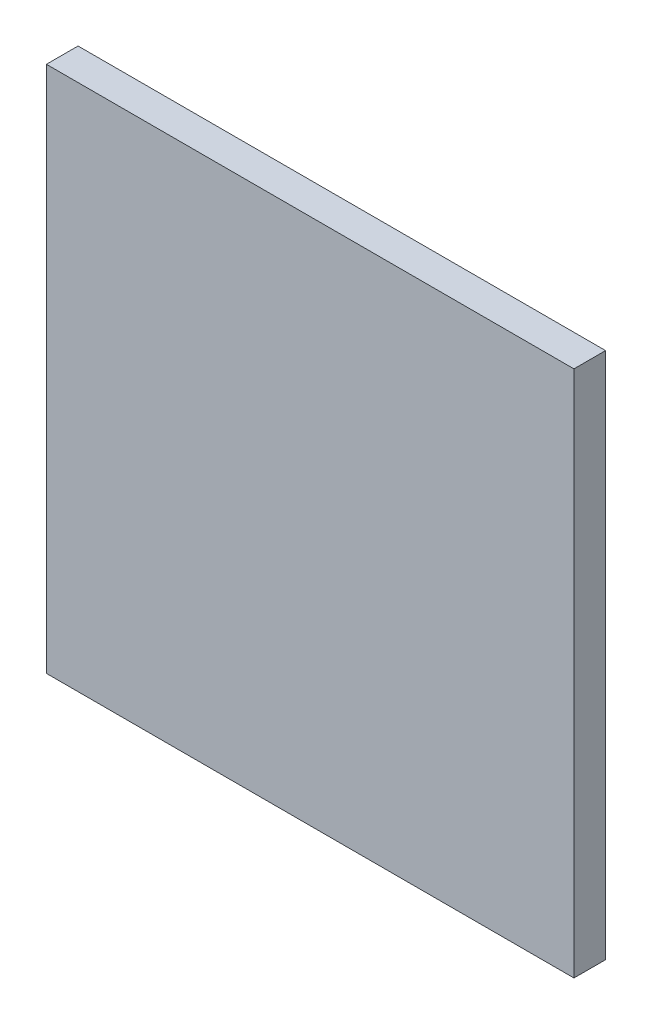
ISO-10303-21;
HEADER;
FILE_DESCRIPTION(('STEP AP214'),'2;1');
FILE_NAME('part.step','',(''),(''),'','','');
FILE_SCHEMA(('AUTOMOTIVE_DESIGN { 1 0 10303 214 1 1 1 1 }'));
ENDSEC;
DATA;
#1=APPLICATION_CONTEXT('core data for automotive mechanical design processes');
#2=APPLICATION_PROTOCOL_DEFINITION('international standard','automotive_design',2000,#1);
#3=PRODUCT_CONTEXT('',#1,'mechanical');
#4=PRODUCT('Part','Part','',(#3));
#5=PRODUCT_RELATED_PRODUCT_CATEGORY('part','',(#4));
#6=PRODUCT_DEFINITION_FORMATION('','',#4);
#7=PRODUCT_DEFINITION_CONTEXT('part definition',#1,'design');
#8=PRODUCT_DEFINITION('design','',#6,#7);
#9=PRODUCT_DEFINITION_SHAPE('','',#8);
#10=(LENGTH_UNIT() NAMED_UNIT(*) SI_UNIT(.MILLI.,.METRE.));
#11=(NAMED_UNIT(*) PLANE_ANGLE_UNIT() SI_UNIT($,.RADIAN.));
#12=(NAMED_UNIT(*) SI_UNIT($,.STERADIAN.) SOLID_ANGLE_UNIT());
#13=UNCERTAINTY_MEASURE_WITH_UNIT(LENGTH_MEASURE(1.E-05),#10,'distance_accuracy_value','');
#14=(GEOMETRIC_REPRESENTATION_CONTEXT(3) GLOBAL_UNCERTAINTY_ASSIGNED_CONTEXT((#13)) GLOBAL_UNIT_ASSIGNED_CONTEXT((#10,
#11,#12)) REPRESENTATION_CONTEXT('',''));
#15=CARTESIAN_POINT('',(0.,0.,0.));
#16=DIRECTION('',(0.,0.,1.));
#17=DIRECTION('',(1.,0.,0.));
#18=AXIS2_PLACEMENT_3D('',#15,#16,#17);
#19=CARTESIAN_POINT('',(25.,25.,3.));
#20=DIRECTION('',(-1.,0.,0.));
#21=DIRECTION('',(0.,-1.,0.));
#22=AXIS2_PLACEMENT_3D('',#19,#20,#21);
#23=PLANE('',#22);
#24=DIRECTION('',(0.,1.,0.));
#25=VECTOR('',#24,1.);
#26=CARTESIAN_POINT('',(25.,25.,0.));
#27=LINE('',#26,#25);
#28=CARTESIAN_POINT('',(25.,-25.,0.));
#29=VERTEX_POINT('',#28);
#30=CARTESIAN_POINT('',(25.,25.,0.));
#31=VERTEX_POINT('',#30);
#32=EDGE_CURVE('E96',#29,#31,#27,.T.);
#33=ORIENTED_EDGE('',*,*,#32,.T.);
#34=DIRECTION('',(0.,0.,-1.));
#35=VECTOR('',#34,1.);
#36=CARTESIAN_POINT('',(25.,25.,3.));
#37=LINE('',#36,#35);
#38=CARTESIAN_POINT('',(25.,25.,3.));
#39=VERTEX_POINT('',#38);
#40=EDGE_CURVE('E11',#39,#31,#37,.T.);
#41=ORIENTED_EDGE('',*,*,#40,.F.);
#42=DIRECTION('',(0.,1.,0.));
#43=VECTOR('',#42,1.);
#44=CARTESIAN_POINT('',(25.,25.,3.));
#45=LINE('',#44,#43);
#46=CARTESIAN_POINT('',(25.,-25.,3.));
#47=VERTEX_POINT('',#46);
#48=EDGE_CURVE('E84',#47,#39,#45,.T.);
#49=ORIENTED_EDGE('',*,*,#48,.F.);
#50=DIRECTION('',(0.,0.,-1.));
#51=VECTOR('',#50,1.);
#52=CARTESIAN_POINT('',(25.,-25.,3.));
#53=LINE('',#52,#51);
#54=EDGE_CURVE('E92',#47,#29,#53,.T.);
#55=ORIENTED_EDGE('',*,*,#54,.T.);
#56=EDGE_LOOP('',(#33,#41,#49,#55));
#57=FACE_BOUND('',#56,.T.);
#58=ADVANCED_FACE('F33',(#57),#23,.F.);
#59=CARTESIAN_POINT('',(-25.,25.,3.));
#60=DIRECTION('',(0.,-1.,0.));
#61=DIRECTION('',(0.,0.,-1.));
#62=AXIS2_PLACEMENT_3D('',#59,#60,#61);
#63=PLANE('',#62);
#64=DIRECTION('',(-1.,0.,0.));
#65=VECTOR('',#64,1.);
#66=CARTESIAN_POINT('',(-25.,25.,0.));
#67=LINE('',#66,#65);
#68=CARTESIAN_POINT('',(-25.,25.,0.));
#69=VERTEX_POINT('',#68);
#70=EDGE_CURVE('E88',#31,#69,#67,.T.);
#71=ORIENTED_EDGE('',*,*,#70,.T.);
#72=DIRECTION('',(0.,0.,-1.));
#73=VECTOR('',#72,1.);
#74=CARTESIAN_POINT('',(-25.,25.,3.));
#75=LINE('',#74,#73);
#76=CARTESIAN_POINT('',(-25.,25.,3.));
#77=VERTEX_POINT('',#76);
#78=EDGE_CURVE('E41',#77,#69,#75,.T.);
#79=ORIENTED_EDGE('',*,*,#78,.F.);
#80=DIRECTION('',(-1.,0.,0.));
#81=VECTOR('',#80,1.);
#82=CARTESIAN_POINT('',(-25.,25.,3.));
#83=LINE('',#82,#81);
#84=EDGE_CURVE('E79',#39,#77,#83,.T.);
#85=ORIENTED_EDGE('',*,*,#84,.F.);
#86=ORIENTED_EDGE('',*,*,#40,.T.);
#87=EDGE_LOOP('',(#71,#79,#85,#86));
#88=FACE_BOUND('',#87,.T.);
#89=ADVANCED_FACE('F87',(#88),#63,.F.);
#90=CARTESIAN_POINT('',(-25.,25.,3.));
#91=DIRECTION('',(1.,0.,0.));
#92=DIRECTION('',(0.,1.,0.));
#93=AXIS2_PLACEMENT_3D('',#90,#91,#92);
#94=PLANE('',#93);
#95=DIRECTION('',(0.,-1.,0.));
#96=VECTOR('',#95,1.);
#97=CARTESIAN_POINT('',(-25.,25.,0.));
#98=LINE('',#97,#96);
#99=CARTESIAN_POINT('',(-25.,-25.,0.));
#100=VERTEX_POINT('',#99);
#101=EDGE_CURVE('E66',#69,#100,#98,.T.);
#102=ORIENTED_EDGE('',*,*,#101,.T.);
#103=DIRECTION('',(0.,0.,-1.));
#104=VECTOR('',#103,1.);
#105=CARTESIAN_POINT('',(-25.,-25.,3.));
#106=LINE('',#105,#104);
#107=CARTESIAN_POINT('',(-25.,-25.,3.));
#108=VERTEX_POINT('',#107);
#109=EDGE_CURVE('E89',#108,#100,#106,.T.);
#110=ORIENTED_EDGE('',*,*,#109,.F.);
#111=DIRECTION('',(0.,-1.,0.));
#112=VECTOR('',#111,1.);
#113=CARTESIAN_POINT('',(-25.,25.,3.));
#114=LINE('',#113,#112);
#115=EDGE_CURVE('E82',#77,#108,#114,.T.);
#116=ORIENTED_EDGE('',*,*,#115,.F.);
#117=ORIENTED_EDGE('',*,*,#78,.T.);
#118=EDGE_LOOP('',(#102,#110,#116,#117));
#119=FACE_BOUND('',#118,.T.);
#120=ADVANCED_FACE('F90',(#119),#94,.F.);
#121=CARTESIAN_POINT('',(-25.,-25.,3.));
#122=DIRECTION('',(0.,1.,0.));
#123=DIRECTION('',(0.,0.,1.));
#124=AXIS2_PLACEMENT_3D('',#121,#122,#123);
#125=PLANE('',#124);
#126=DIRECTION('',(1.,0.,0.));
#127=VECTOR('',#126,1.);
#128=CARTESIAN_POINT('',(-25.,-25.,0.));
#129=LINE('',#128,#127);
#130=EDGE_CURVE('E72',#100,#29,#129,.T.);
#131=ORIENTED_EDGE('',*,*,#130,.T.);
#132=ORIENTED_EDGE('',*,*,#54,.F.);
#133=DIRECTION('',(1.,0.,0.));
#134=VECTOR('',#133,1.);
#135=CARTESIAN_POINT('',(-25.,-25.,3.));
#136=LINE('',#135,#134);
#137=EDGE_CURVE('E49',#108,#47,#136,.T.);
#138=ORIENTED_EDGE('',*,*,#137,.F.);
#139=ORIENTED_EDGE('',*,*,#109,.T.);
#140=EDGE_LOOP('',(#131,#132,#138,#139));
#141=FACE_BOUND('',#140,.T.);
#142=ADVANCED_FACE('F103',(#141),#125,.F.);
#143=CARTESIAN_POINT('',(0.,0.,3.));
#144=DIRECTION('',(0.,0.,1.));
#145=DIRECTION('',(1.,0.,0.));
#146=AXIS2_PLACEMENT_3D('',#143,#144,#145);
#147=PLANE('',#146);
#148=ORIENTED_EDGE('',*,*,#48,.T.);
#149=ORIENTED_EDGE('',*,*,#84,.T.);
#150=ORIENTED_EDGE('',*,*,#115,.T.);
#151=ORIENTED_EDGE('',*,*,#137,.T.);
#152=EDGE_LOOP('',(#148,#149,#150,#151));
#153=FACE_BOUND('',#152,.T.);
#154=ADVANCED_FACE('F80',(#153),#147,.T.);
#155=CARTESIAN_POINT('',(0.,0.,0.));
#156=DIRECTION('',(0.,0.,1.));
#157=DIRECTION('',(1.,0.,0.));
#158=AXIS2_PLACEMENT_3D('',#155,#156,#157);
#159=PLANE('',#158);
#160=ORIENTED_EDGE('',*,*,#32,.F.);
#161=ORIENTED_EDGE('',*,*,#130,.F.);
#162=ORIENTED_EDGE('',*,*,#101,.F.);
#163=ORIENTED_EDGE('',*,*,#70,.F.);
#164=EDGE_LOOP('',(#160,#161,#162,#163));
#165=FACE_BOUND('',#164,.T.);
#166=ADVANCED_FACE('F106',(#165),#159,.F.);
#167=CLOSED_SHELL('',(#58,#89,#120,#142,#154,#166));
#168=MANIFOLD_SOLID_BREP('B2',#167);
#169=ADVANCED_BREP_SHAPE_REPRESENTATION('',(#18,#168),#14);
#170=SHAPE_DEFINITION_REPRESENTATION(#9,#169);
ENDSEC;
END-ISO-10303-21;
